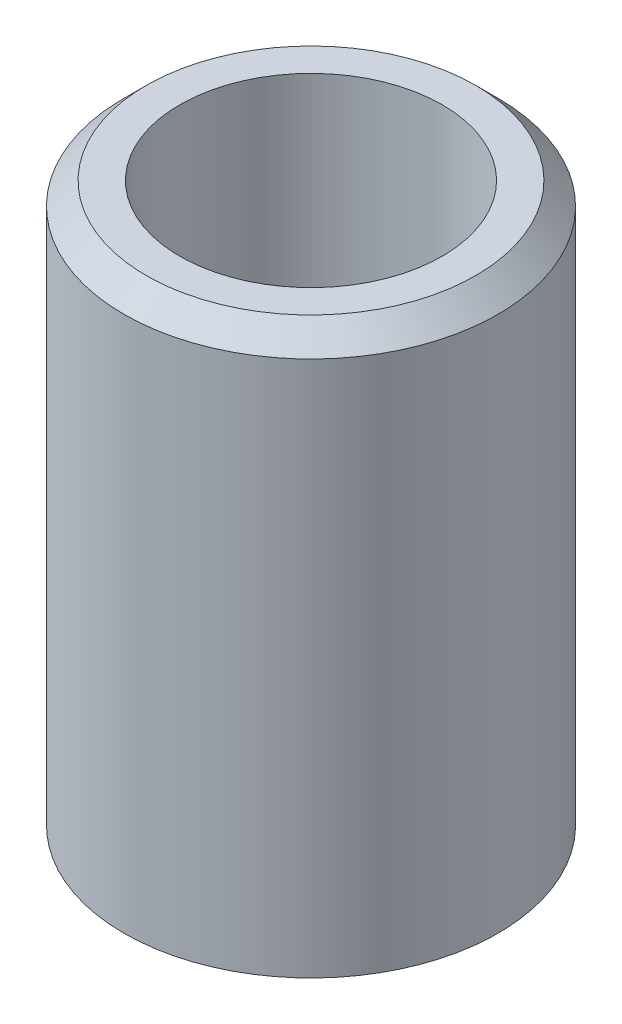
ISO-10303-21;
HEADER;
FILE_DESCRIPTION(('STEP AP214'),'2;1');
FILE_NAME('part.step','',(''),(''),'','','');
FILE_SCHEMA(('AUTOMOTIVE_DESIGN { 1 0 10303 214 1 1 1 1 }'));
ENDSEC;
DATA;
#1=APPLICATION_CONTEXT('core data for automotive mechanical design processes');
#2=APPLICATION_PROTOCOL_DEFINITION('international standard','automotive_design',2000,#1);
#3=PRODUCT_CONTEXT('',#1,'mechanical');
#4=PRODUCT('Part','Part','',(#3));
#5=PRODUCT_RELATED_PRODUCT_CATEGORY('part','',(#4));
#6=PRODUCT_DEFINITION_FORMATION('','',#4);
#7=PRODUCT_DEFINITION_CONTEXT('part definition',#1,'design');
#8=PRODUCT_DEFINITION('design','',#6,#7);
#9=PRODUCT_DEFINITION_SHAPE('','',#8);
#10=(LENGTH_UNIT() NAMED_UNIT(*) SI_UNIT(.MILLI.,.METRE.));
#11=(NAMED_UNIT(*) PLANE_ANGLE_UNIT() SI_UNIT($,.RADIAN.));
#12=(NAMED_UNIT(*) SI_UNIT($,.STERADIAN.) SOLID_ANGLE_UNIT());
#13=UNCERTAINTY_MEASURE_WITH_UNIT(LENGTH_MEASURE(1.E-05),#10,'distance_accuracy_value','');
#14=(GEOMETRIC_REPRESENTATION_CONTEXT(3) GLOBAL_UNCERTAINTY_ASSIGNED_CONTEXT((#13)) GLOBAL_UNIT_ASSIGNED_CONTEXT((#10,
#11,#12)) REPRESENTATION_CONTEXT('',''));
#15=CARTESIAN_POINT('',(0.,0.,0.));
#16=DIRECTION('',(0.,0.,1.));
#17=DIRECTION('',(1.,0.,0.));
#18=AXIS2_PLACEMENT_3D('',#15,#16,#17);
#19=CARTESIAN_POINT('',(0.,0.,0.));
#20=DIRECTION('',(0.,-1.,0.));
#21=DIRECTION('',(0.,0.,-1.));
#22=AXIS2_PLACEMENT_3D('',#19,#20,#21);
#23=CYLINDRICAL_SURFACE('',#22,8.375);
#24=CARTESIAN_POINT('',(0.,24.,0.));
#25=DIRECTION('',(0.,-1.,0.));
#26=DIRECTION('',(0.,0.,-1.));
#27=AXIS2_PLACEMENT_3D('',#24,#25,#26);
#28=CIRCLE('',#27,8.375);
#29=CARTESIAN_POINT('',(0.,24.,-8.375));
#30=VERTEX_POINT('',#29);
#31=EDGE_CURVE('E47',#30,#30,#28,.T.);
#32=ORIENTED_EDGE('',*,*,#31,.T.);
#33=EDGE_LOOP('',(#32));
#34=FACE_BOUND('',#33,.T.);
#35=CARTESIAN_POINT('',(0.,0.,0.));
#36=DIRECTION('',(0.,-1.,0.));
#37=DIRECTION('',(0.,0.,-1.));
#38=AXIS2_PLACEMENT_3D('',#35,#36,#37);
#39=CIRCLE('',#38,8.375);
#40=CARTESIAN_POINT('',(0.,0.,-8.375));
#41=VERTEX_POINT('',#40);
#42=EDGE_CURVE('E60',#41,#41,#39,.T.);
#43=ORIENTED_EDGE('',*,*,#42,.F.);
#44=EDGE_LOOP('',(#43));
#45=FACE_BOUND('',#44,.T.);
#46=ADVANCED_FACE('F39',(#34,#45),#23,.T.);
#47=CARTESIAN_POINT('',(-8.375,25.,0.));
#48=DIRECTION('',(0.,-1.,0.));
#49=DIRECTION('',(0.,0.,-1.));
#50=AXIS2_PLACEMENT_3D('',#47,#48,#49);
#51=PLANE('',#50);
#52=CARTESIAN_POINT('',(0.,25.,0.));
#53=DIRECTION('',(0.,-1.,0.));
#54=DIRECTION('',(0.,0.,-1.));
#55=AXIS2_PLACEMENT_3D('',#52,#53,#54);
#56=CIRCLE('',#55,7.375);
#57=CARTESIAN_POINT('',(0.,25.,-7.375));
#58=VERTEX_POINT('',#57);
#59=EDGE_CURVE('E10',#58,#58,#56,.F.);
#60=ORIENTED_EDGE('',*,*,#59,.T.);
#61=EDGE_LOOP('',(#60));
#62=FACE_BOUND('',#61,.T.);
#63=CARTESIAN_POINT('',(0.,25.,0.));
#64=DIRECTION('',(0.,-1.,0.));
#65=DIRECTION('',(0.,0.,-1.));
#66=AXIS2_PLACEMENT_3D('',#63,#64,#65);
#67=CIRCLE('',#66,5.875);
#68=CARTESIAN_POINT('',(0.,25.,-5.875));
#69=VERTEX_POINT('',#68);
#70=EDGE_CURVE('E51',#69,#69,#67,.T.);
#71=ORIENTED_EDGE('',*,*,#70,.T.);
#72=EDGE_LOOP('',(#71));
#73=FACE_BOUND('',#72,.T.);
#74=ADVANCED_FACE('F67',(#62,#73),#51,.F.);
#75=CARTESIAN_POINT('',(0.,0.,0.));
#76=DIRECTION('',(0.,-1.,0.));
#77=DIRECTION('',(0.,0.,-1.));
#78=AXIS2_PLACEMENT_3D('',#75,#76,#77);
#79=CYLINDRICAL_SURFACE('',#78,5.875);
#80=ORIENTED_EDGE('',*,*,#70,.F.);
#81=EDGE_LOOP('',(#80));
#82=FACE_BOUND('',#81,.T.);
#83=CARTESIAN_POINT('',(0.,0.,0.));
#84=DIRECTION('',(0.,-1.,0.));
#85=DIRECTION('',(0.,0.,-1.));
#86=AXIS2_PLACEMENT_3D('',#83,#84,#85);
#87=CIRCLE('',#86,5.875);
#88=CARTESIAN_POINT('',(0.,0.,-5.875));
#89=VERTEX_POINT('',#88);
#90=EDGE_CURVE('E55',#89,#89,#87,.T.);
#91=ORIENTED_EDGE('',*,*,#90,.T.);
#92=EDGE_LOOP('',(#91));
#93=FACE_BOUND('',#92,.T.);
#94=ADVANCED_FACE('F72',(#82,#93),#79,.F.);
#95=CARTESIAN_POINT('',(-8.375,0.,0.));
#96=DIRECTION('',(0.,1.,0.));
#97=DIRECTION('',(0.,0.,1.));
#98=AXIS2_PLACEMENT_3D('',#95,#96,#97);
#99=PLANE('',#98);
#100=ORIENTED_EDGE('',*,*,#90,.F.);
#101=EDGE_LOOP('',(#100));
#102=FACE_BOUND('',#101,.T.);
#103=ORIENTED_EDGE('',*,*,#42,.T.);
#104=EDGE_LOOP('',(#103));
#105=FACE_BOUND('',#104,.T.);
#106=ADVANCED_FACE('F64',(#102,#105),#99,.F.);
#107=CARTESIAN_POINT('',(0.,24.,0.));
#108=DIRECTION('',(0.,-1.,0.));
#109=DIRECTION('',(0.,0.,-1.));
#110=AXIS2_PLACEMENT_3D('',#107,#108,#109);
#111=CONICAL_SURFACE('',#110,8.375,0.78539816339745);
#112=ORIENTED_EDGE('',*,*,#59,.F.);
#113=EDGE_LOOP('',(#112));
#114=FACE_BOUND('',#113,.T.);
#115=ORIENTED_EDGE('',*,*,#31,.F.);
#116=EDGE_LOOP('',(#115));
#117=FACE_BOUND('',#116,.T.);
#118=ADVANCED_FACE('F42',(#114,#117),#111,.T.);
#119=CLOSED_SHELL('',(#46,#74,#94,#106,#118));
#120=MANIFOLD_SOLID_BREP('B2',#119);
#121=ADVANCED_BREP_SHAPE_REPRESENTATION('',(#18,#120),#14);
#122=SHAPE_DEFINITION_REPRESENTATION(#9,#121);
ENDSEC;
END-ISO-10303-21;
